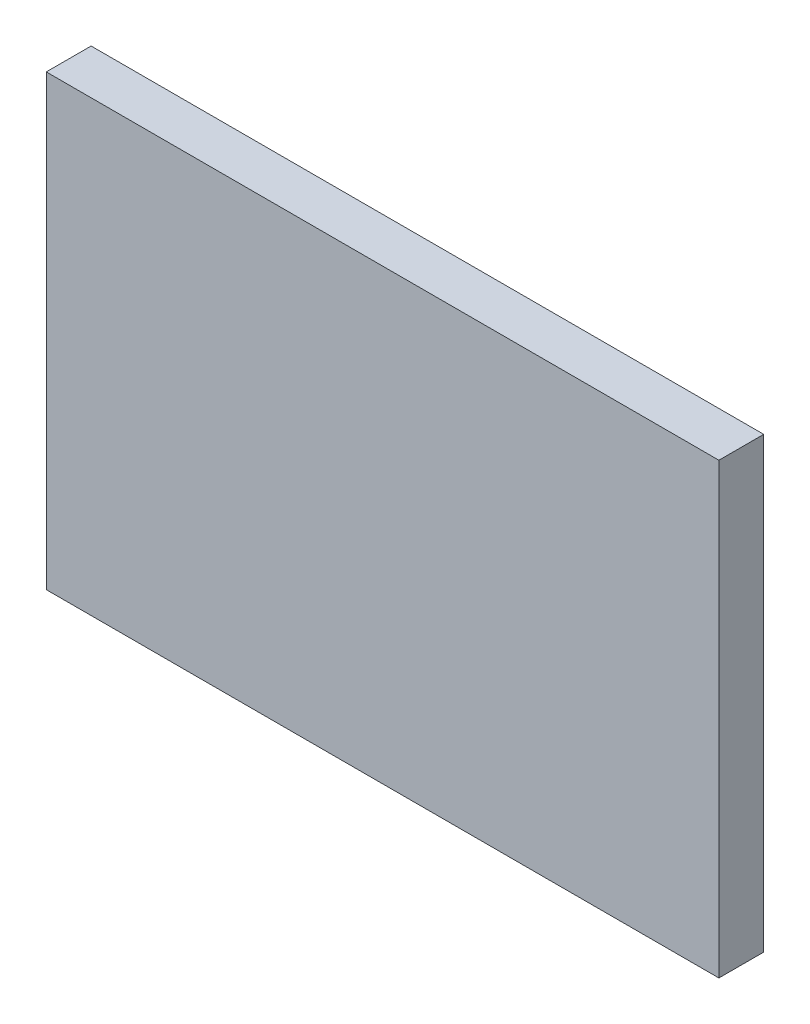
ISO-10303-21;
HEADER;
FILE_DESCRIPTION(('STEP AP214'),'2;1');
FILE_NAME('part.step','',(''),(''),'','','');
FILE_SCHEMA(('AUTOMOTIVE_DESIGN { 1 0 10303 214 1 1 1 1 }'));
ENDSEC;
DATA;
#1=APPLICATION_CONTEXT('core data for automotive mechanical design processes');
#2=APPLICATION_PROTOCOL_DEFINITION('international standard','automotive_design',2000,#1);
#3=PRODUCT_CONTEXT('',#1,'mechanical');
#4=PRODUCT('Part','Part','',(#3));
#5=PRODUCT_RELATED_PRODUCT_CATEGORY('part','',(#4));
#6=PRODUCT_DEFINITION_FORMATION('','',#4);
#7=PRODUCT_DEFINITION_CONTEXT('part definition',#1,'design');
#8=PRODUCT_DEFINITION('design','',#6,#7);
#9=PRODUCT_DEFINITION_SHAPE('','',#8);
#10=(LENGTH_UNIT() NAMED_UNIT(*) SI_UNIT(.MILLI.,.METRE.));
#11=(NAMED_UNIT(*) PLANE_ANGLE_UNIT() SI_UNIT($,.RADIAN.));
#12=(NAMED_UNIT(*) SI_UNIT($,.STERADIAN.) SOLID_ANGLE_UNIT());
#13=UNCERTAINTY_MEASURE_WITH_UNIT(LENGTH_MEASURE(1.E-05),#10,'distance_accuracy_value','');
#14=(GEOMETRIC_REPRESENTATION_CONTEXT(3) GLOBAL_UNCERTAINTY_ASSIGNED_CONTEXT((#13)) GLOBAL_UNIT_ASSIGNED_CONTEXT((#10,
#11,#12)) REPRESENTATION_CONTEXT('',''));
#15=CARTESIAN_POINT('',(0.,0.,0.));
#16=DIRECTION('',(0.,0.,1.));
#17=DIRECTION('',(1.,0.,0.));
#18=AXIS2_PLACEMENT_3D('',#15,#16,#17);
#19=CARTESIAN_POINT('',(-151.757177921654,-48.8668555240793,20.));
#20=DIRECTION('',(1.,0.,0.));
#21=DIRECTION('',(0.,0.,-1.));
#22=AXIS2_PLACEMENT_3D('',#19,#20,#21);
#23=PLANE('',#22);
#24=DIRECTION('',(0.,-1.,0.));
#25=VECTOR('',#24,1.);
#26=CARTESIAN_POINT('',(-151.757177921654,-48.8668555240793,0.));
#27=LINE('',#26,#25);
#28=CARTESIAN_POINT('',(-151.757177921654,151.133144475921,0.));
#29=VERTEX_POINT('',#28);
#30=CARTESIAN_POINT('',(-151.757177921654,-48.8668555240793,0.));
#31=VERTEX_POINT('',#30);
#32=EDGE_CURVE('E107',#29,#31,#27,.T.);
#33=ORIENTED_EDGE('',*,*,#32,.T.);
#34=DIRECTION('',(0.,0.,-1.));
#35=VECTOR('',#34,1.);
#36=CARTESIAN_POINT('',(-151.757177921654,-48.8668555240793,20.));
#37=LINE('',#36,#35);
#38=CARTESIAN_POINT('',(-151.757177921654,-48.8668555240793,20.));
#39=VERTEX_POINT('',#38);
#40=EDGE_CURVE('E11',#39,#31,#37,.T.);
#41=ORIENTED_EDGE('',*,*,#40,.F.);
#42=DIRECTION('',(0.,-1.,0.));
#43=VECTOR('',#42,1.);
#44=CARTESIAN_POINT('',(-151.757177921654,-48.8668555240793,20.));
#45=LINE('',#44,#43);
#46=CARTESIAN_POINT('',(-151.757177921654,151.133144475921,20.));
#47=VERTEX_POINT('',#46);
#48=EDGE_CURVE('E91',#47,#39,#45,.T.);
#49=ORIENTED_EDGE('',*,*,#48,.F.);
#50=DIRECTION('',(0.,0.,-1.));
#51=VECTOR('',#50,1.);
#52=CARTESIAN_POINT('',(-151.757177921654,151.133144475921,20.));
#53=LINE('',#52,#51);
#54=EDGE_CURVE('E103',#47,#29,#53,.T.);
#55=ORIENTED_EDGE('',*,*,#54,.T.);
#56=EDGE_LOOP('',(#33,#41,#49,#55));
#57=FACE_BOUND('',#56,.T.);
#58=ADVANCED_FACE('F39',(#57),#23,.F.);
#59=CARTESIAN_POINT('',(-151.757177921654,-48.8668555240793,20.));
#60=DIRECTION('',(0.,1.,0.));
#61=DIRECTION('',(0.,0.,1.));
#62=AXIS2_PLACEMENT_3D('',#59,#60,#61);
#63=PLANE('',#62);
#64=DIRECTION('',(1.,0.,0.));
#65=VECTOR('',#64,1.);
#66=CARTESIAN_POINT('',(-151.757177921654,-48.8668555240793,0.));
#67=LINE('',#66,#65);
#68=CARTESIAN_POINT('',(148.242822078346,-48.8668555240793,0.));
#69=VERTEX_POINT('',#68);
#70=EDGE_CURVE('E96',#31,#69,#67,.T.);
#71=ORIENTED_EDGE('',*,*,#70,.T.);
#72=DIRECTION('',(0.,0.,-1.));
#73=VECTOR('',#72,1.);
#74=CARTESIAN_POINT('',(148.242822078346,-48.8668555240793,20.));
#75=LINE('',#74,#73);
#76=CARTESIAN_POINT('',(148.242822078346,-48.8668555240793,20.));
#77=VERTEX_POINT('',#76);
#78=EDGE_CURVE('E48',#77,#69,#75,.T.);
#79=ORIENTED_EDGE('',*,*,#78,.F.);
#80=DIRECTION('',(1.,0.,0.));
#81=VECTOR('',#80,1.);
#82=CARTESIAN_POINT('',(-151.757177921654,-48.8668555240793,20.));
#83=LINE('',#82,#81);
#84=EDGE_CURVE('E86',#39,#77,#83,.T.);
#85=ORIENTED_EDGE('',*,*,#84,.F.);
#86=ORIENTED_EDGE('',*,*,#40,.T.);
#87=EDGE_LOOP('',(#71,#79,#85,#86));
#88=FACE_BOUND('',#87,.T.);
#89=ADVANCED_FACE('F95',(#88),#63,.F.);
#90=CARTESIAN_POINT('',(148.242822078346,-48.8668555240793,20.));
#91=DIRECTION('',(-1.,0.,0.));
#92=DIRECTION('',(0.,0.,1.));
#93=AXIS2_PLACEMENT_3D('',#90,#91,#92);
#94=PLANE('',#93);
#95=DIRECTION('',(0.,1.,0.));
#96=VECTOR('',#95,1.);
#97=CARTESIAN_POINT('',(148.242822078346,-48.8668555240793,0.));
#98=LINE('',#97,#96);
#99=CARTESIAN_POINT('',(148.242822078346,151.133144475921,0.));
#100=VERTEX_POINT('',#99);
#101=EDGE_CURVE('E73',#69,#100,#98,.T.);
#102=ORIENTED_EDGE('',*,*,#101,.T.);
#103=DIRECTION('',(0.,0.,-1.));
#104=VECTOR('',#103,1.);
#105=CARTESIAN_POINT('',(148.242822078346,151.133144475921,20.));
#106=LINE('',#105,#104);
#107=CARTESIAN_POINT('',(148.242822078346,151.133144475921,20.));
#108=VERTEX_POINT('',#107);
#109=EDGE_CURVE('E98',#108,#100,#106,.T.);
#110=ORIENTED_EDGE('',*,*,#109,.F.);
#111=DIRECTION('',(0.,1.,0.));
#112=VECTOR('',#111,1.);
#113=CARTESIAN_POINT('',(148.242822078346,-48.8668555240793,20.));
#114=LINE('',#113,#112);
#115=EDGE_CURVE('E89',#77,#108,#114,.T.);
#116=ORIENTED_EDGE('',*,*,#115,.F.);
#117=ORIENTED_EDGE('',*,*,#78,.T.);
#118=EDGE_LOOP('',(#102,#110,#116,#117));
#119=FACE_BOUND('',#118,.T.);
#120=ADVANCED_FACE('F99',(#119),#94,.F.);
#121=CARTESIAN_POINT('',(-151.757177921654,151.133144475921,20.));
#122=DIRECTION('',(0.,-1.,0.));
#123=DIRECTION('',(0.,0.,-1.));
#124=AXIS2_PLACEMENT_3D('',#121,#122,#123);
#125=PLANE('',#124);
#126=DIRECTION('',(-1.,0.,0.));
#127=VECTOR('',#126,1.);
#128=CARTESIAN_POINT('',(-151.757177921654,151.133144475921,0.));
#129=LINE('',#128,#127);
#130=EDGE_CURVE('E79',#100,#29,#129,.T.);
#131=ORIENTED_EDGE('',*,*,#130,.T.);
#132=ORIENTED_EDGE('',*,*,#54,.F.);
#133=DIRECTION('',(-1.,0.,0.));
#134=VECTOR('',#133,1.);
#135=CARTESIAN_POINT('',(-151.757177921654,151.133144475921,20.));
#136=LINE('',#135,#134);
#137=EDGE_CURVE('E56',#108,#47,#136,.T.);
#138=ORIENTED_EDGE('',*,*,#137,.F.);
#139=ORIENTED_EDGE('',*,*,#109,.T.);
#140=EDGE_LOOP('',(#131,#132,#138,#139));
#141=FACE_BOUND('',#140,.T.);
#142=ADVANCED_FACE('F120',(#141),#125,.F.);
#143=CARTESIAN_POINT('',(0.,0.,20.));
#144=DIRECTION('',(0.,0.,-1.));
#145=DIRECTION('',(-1.,0.,0.));
#146=AXIS2_PLACEMENT_3D('',#143,#144,#145);
#147=PLANE('',#146);
#148=ORIENTED_EDGE('',*,*,#48,.T.);
#149=ORIENTED_EDGE('',*,*,#84,.T.);
#150=ORIENTED_EDGE('',*,*,#115,.T.);
#151=ORIENTED_EDGE('',*,*,#137,.T.);
#152=EDGE_LOOP('',(#148,#149,#150,#151));
#153=FACE_BOUND('',#152,.T.);
#154=ADVANCED_FACE('F87',(#153),#147,.F.);
#155=CARTESIAN_POINT('',(0.,0.,0.));
#156=DIRECTION('',(0.,0.,-1.));
#157=DIRECTION('',(-1.,0.,0.));
#158=AXIS2_PLACEMENT_3D('',#155,#156,#157);
#159=PLANE('',#158);
#160=ORIENTED_EDGE('',*,*,#32,.F.);
#161=ORIENTED_EDGE('',*,*,#130,.F.);
#162=ORIENTED_EDGE('',*,*,#101,.F.);
#163=ORIENTED_EDGE('',*,*,#70,.F.);
#164=EDGE_LOOP('',(#160,#161,#162,#163));
#165=FACE_BOUND('',#164,.T.);
#166=ADVANCED_FACE('F123',(#165),#159,.T.);
#167=CLOSED_SHELL('',(#58,#89,#120,#142,#154,#166));
#168=MANIFOLD_SOLID_BREP('B2',#167);
#169=ADVANCED_BREP_SHAPE_REPRESENTATION('',(#18,#168),#14);
#170=SHAPE_DEFINITION_REPRESENTATION(#9,#169);
ENDSEC;
END-ISO-10303-21;
